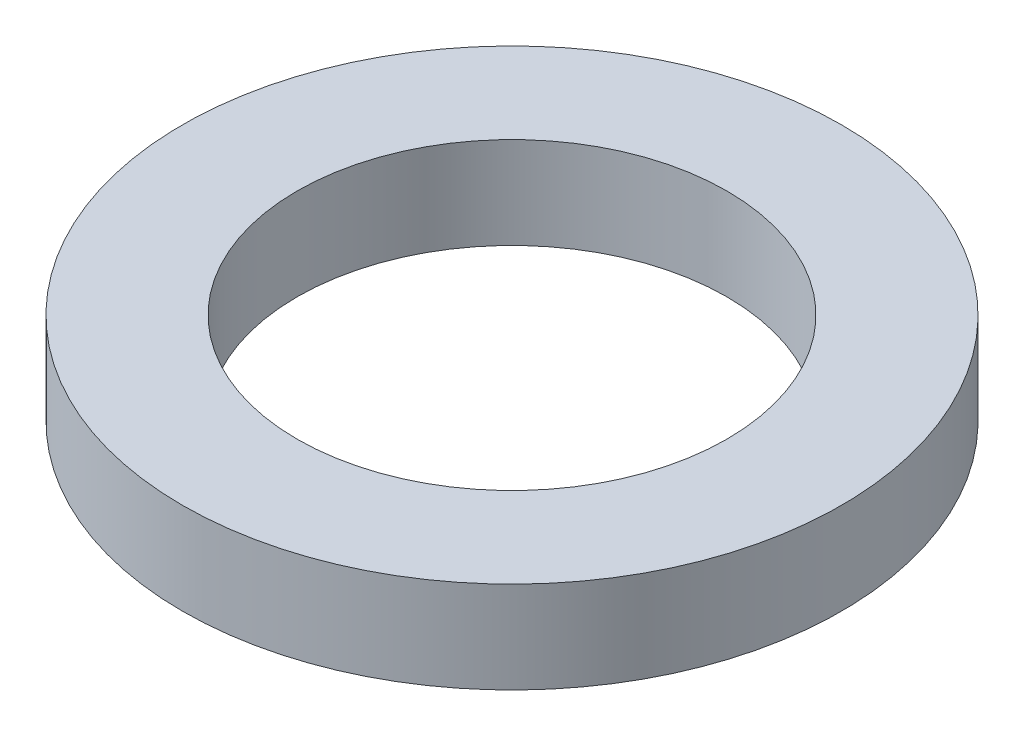
ISO-10303-21;
HEADER;
FILE_DESCRIPTION(('STEP AP214'),'2;1');
FILE_NAME('part.step','',(''),(''),'','','');
FILE_SCHEMA(('AUTOMOTIVE_DESIGN { 1 0 10303 214 1 1 1 1 }'));
ENDSEC;
DATA;
#1=APPLICATION_CONTEXT('core data for automotive mechanical design processes');
#2=APPLICATION_PROTOCOL_DEFINITION('international standard','automotive_design',2000,#1);
#3=PRODUCT_CONTEXT('',#1,'mechanical');
#4=PRODUCT('Part','Part','',(#3));
#5=PRODUCT_RELATED_PRODUCT_CATEGORY('part','',(#4));
#6=PRODUCT_DEFINITION_FORMATION('','',#4);
#7=PRODUCT_DEFINITION_CONTEXT('part definition',#1,'design');
#8=PRODUCT_DEFINITION('design','',#6,#7);
#9=PRODUCT_DEFINITION_SHAPE('','',#8);
#10=(LENGTH_UNIT() NAMED_UNIT(*) SI_UNIT(.MILLI.,.METRE.));
#11=(NAMED_UNIT(*) PLANE_ANGLE_UNIT() SI_UNIT($,.RADIAN.));
#12=(NAMED_UNIT(*) SI_UNIT($,.STERADIAN.) SOLID_ANGLE_UNIT());
#13=UNCERTAINTY_MEASURE_WITH_UNIT(LENGTH_MEASURE(1.E-05),#10,'distance_accuracy_value','');
#14=(GEOMETRIC_REPRESENTATION_CONTEXT(3) GLOBAL_UNCERTAINTY_ASSIGNED_CONTEXT((#13)) GLOBAL_UNIT_ASSIGNED_CONTEXT((#10,
#11,#12)) REPRESENTATION_CONTEXT('',''));
#15=CARTESIAN_POINT('',(0.,0.,0.));
#16=DIRECTION('',(0.,0.,1.));
#17=DIRECTION('',(1.,0.,0.));
#18=AXIS2_PLACEMENT_3D('',#15,#16,#17);
#19=CARTESIAN_POINT('',(0.,16.,0.));
#20=DIRECTION('',(0.,-1.,0.));
#21=DIRECTION('',(0.,0.,-1.));
#22=AXIS2_PLACEMENT_3D('',#19,#20,#21);
#23=CYLINDRICAL_SURFACE('',#22,57.5);
#24=CARTESIAN_POINT('',(0.,16.,0.));
#25=DIRECTION('',(0.,1.,0.));
#26=DIRECTION('',(0.,0.,1.));
#27=AXIS2_PLACEMENT_3D('',#24,#25,#26);
#28=CIRCLE('',#27,57.5);
#29=CARTESIAN_POINT('',(0.,16.,57.5));
#30=VERTEX_POINT('',#29);
#31=EDGE_CURVE('E10',#30,#30,#28,.T.);
#32=ORIENTED_EDGE('',*,*,#31,.F.);
#33=EDGE_LOOP('',(#32));
#34=FACE_BOUND('',#33,.T.);
#35=CARTESIAN_POINT('',(0.,0.,0.));
#36=DIRECTION('',(0.,1.,0.));
#37=DIRECTION('',(0.,0.,1.));
#38=AXIS2_PLACEMENT_3D('',#35,#36,#37);
#39=CIRCLE('',#38,57.5);
#40=CARTESIAN_POINT('',(0.,0.,57.5));
#41=VERTEX_POINT('',#40);
#42=EDGE_CURVE('E37',#41,#41,#39,.T.);
#43=ORIENTED_EDGE('',*,*,#42,.T.);
#44=EDGE_LOOP('',(#43));
#45=FACE_BOUND('',#44,.T.);
#46=ADVANCED_FACE('F40',(#34,#45),#23,.T.);
#47=CARTESIAN_POINT('',(0.,16.,0.));
#48=DIRECTION('',(0.,1.,0.));
#49=DIRECTION('',(0.,0.,1.));
#50=AXIS2_PLACEMENT_3D('',#47,#48,#49);
#51=PLANE('',#50);
#52=CARTESIAN_POINT('',(0.,16.,0.));
#53=DIRECTION('',(0.,1.,0.));
#54=DIRECTION('',(0.,0.,1.));
#55=AXIS2_PLACEMENT_3D('',#52,#53,#54);
#56=CIRCLE('',#55,37.5);
#57=CARTESIAN_POINT('',(0.,16.,37.5));
#58=VERTEX_POINT('',#57);
#59=EDGE_CURVE('E50',#58,#58,#56,.T.);
#60=ORIENTED_EDGE('',*,*,#59,.F.);
#61=EDGE_LOOP('',(#60));
#62=FACE_BOUND('',#61,.T.);
#63=ORIENTED_EDGE('',*,*,#31,.T.);
#64=EDGE_LOOP('',(#63));
#65=FACE_BOUND('',#64,.T.);
#66=ADVANCED_FACE('F59',(#62,#65),#51,.T.);
#67=CARTESIAN_POINT('',(0.,0.,0.));
#68=DIRECTION('',(0.,1.,0.));
#69=DIRECTION('',(0.,0.,1.));
#70=AXIS2_PLACEMENT_3D('',#67,#68,#69);
#71=PLANE('',#70);
#72=CARTESIAN_POINT('',(0.,0.,0.));
#73=DIRECTION('',(0.,1.,0.));
#74=DIRECTION('',(0.,0.,1.));
#75=AXIS2_PLACEMENT_3D('',#72,#73,#74);
#76=CIRCLE('',#75,37.5);
#77=CARTESIAN_POINT('',(0.,0.,37.5));
#78=VERTEX_POINT('',#77);
#79=EDGE_CURVE('E47',#78,#78,#76,.T.);
#80=ORIENTED_EDGE('',*,*,#79,.T.);
#81=EDGE_LOOP('',(#80));
#82=FACE_BOUND('',#81,.T.);
#83=ORIENTED_EDGE('',*,*,#42,.F.);
#84=EDGE_LOOP('',(#83));
#85=FACE_BOUND('',#84,.T.);
#86=ADVANCED_FACE('F58',(#82,#85),#71,.F.);
#87=CARTESIAN_POINT('',(0.,16.,0.));
#88=DIRECTION('',(0.,-1.,0.));
#89=DIRECTION('',(0.,0.,-1.));
#90=AXIS2_PLACEMENT_3D('',#87,#88,#89);
#91=CYLINDRICAL_SURFACE('',#90,37.5);
#92=ORIENTED_EDGE('',*,*,#59,.T.);
#93=EDGE_LOOP('',(#92));
#94=FACE_BOUND('',#93,.T.);
#95=ORIENTED_EDGE('',*,*,#79,.F.);
#96=EDGE_LOOP('',(#95));
#97=FACE_BOUND('',#96,.T.);
#98=ADVANCED_FACE('F54',(#94,#97),#91,.F.);
#99=CLOSED_SHELL('',(#46,#66,#86,#98));
#100=MANIFOLD_SOLID_BREP('B2',#99);
#101=ADVANCED_BREP_SHAPE_REPRESENTATION('',(#18,#100),#14);
#102=SHAPE_DEFINITION_REPRESENTATION(#9,#101);
ENDSEC;
END-ISO-10303-21;
